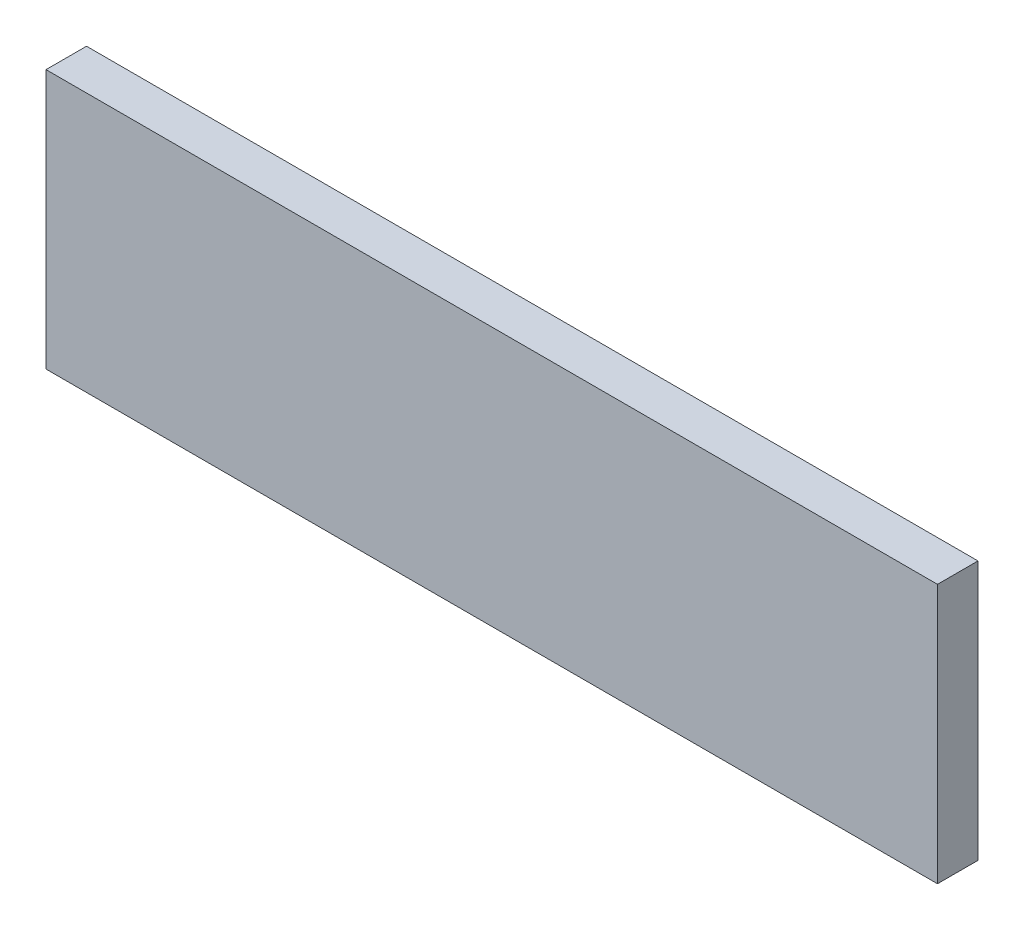
ISO-10303-21;
HEADER;
FILE_DESCRIPTION(('STEP AP214'),'2;1');
FILE_NAME('part.step','',(''),(''),'','','');
FILE_SCHEMA(('AUTOMOTIVE_DESIGN { 1 0 10303 214 1 1 1 1 }'));
ENDSEC;
DATA;
#1=APPLICATION_CONTEXT('core data for automotive mechanical design processes');
#2=APPLICATION_PROTOCOL_DEFINITION('international standard','automotive_design',2000,#1);
#3=PRODUCT_CONTEXT('',#1,'mechanical');
#4=PRODUCT('Part','Part','',(#3));
#5=PRODUCT_RELATED_PRODUCT_CATEGORY('part','',(#4));
#6=PRODUCT_DEFINITION_FORMATION('','',#4);
#7=PRODUCT_DEFINITION_CONTEXT('part definition',#1,'design');
#8=PRODUCT_DEFINITION('design','',#6,#7);
#9=PRODUCT_DEFINITION_SHAPE('','',#8);
#10=(LENGTH_UNIT() NAMED_UNIT(*) SI_UNIT(.MILLI.,.METRE.));
#11=(NAMED_UNIT(*) PLANE_ANGLE_UNIT() SI_UNIT($,.RADIAN.));
#12=(NAMED_UNIT(*) SI_UNIT($,.STERADIAN.) SOLID_ANGLE_UNIT());
#13=UNCERTAINTY_MEASURE_WITH_UNIT(LENGTH_MEASURE(1.E-05),#10,'distance_accuracy_value','');
#14=(GEOMETRIC_REPRESENTATION_CONTEXT(3) GLOBAL_UNCERTAINTY_ASSIGNED_CONTEXT((#13)) GLOBAL_UNIT_ASSIGNED_CONTEXT((#10,
#11,#12)) REPRESENTATION_CONTEXT('',''));
#15=CARTESIAN_POINT('',(0.,0.,0.));
#16=DIRECTION('',(0.,0.,1.));
#17=DIRECTION('',(1.,0.,0.));
#18=AXIS2_PLACEMENT_3D('',#15,#16,#17);
#19=CARTESIAN_POINT('',(27.5,-8.,2.5));
#20=DIRECTION('',(-1.,0.,0.));
#21=DIRECTION('',(0.,0.,1.));
#22=AXIS2_PLACEMENT_3D('',#19,#20,#21);
#23=PLANE('',#22);
#24=DIRECTION('',(0.,1.,0.));
#25=VECTOR('',#24,1.);
#26=CARTESIAN_POINT('',(27.5,-8.,0.));
#27=LINE('',#26,#25);
#28=CARTESIAN_POINT('',(27.5,-8.,0.));
#29=VERTEX_POINT('',#28);
#30=CARTESIAN_POINT('',(27.5,8.,0.));
#31=VERTEX_POINT('',#30);
#32=EDGE_CURVE('E96',#29,#31,#27,.T.);
#33=ORIENTED_EDGE('',*,*,#32,.T.);
#34=DIRECTION('',(0.,0.,-1.));
#35=VECTOR('',#34,1.);
#36=CARTESIAN_POINT('',(27.5,8.,2.5));
#37=LINE('',#36,#35);
#38=CARTESIAN_POINT('',(27.5,8.,2.5));
#39=VERTEX_POINT('',#38);
#40=EDGE_CURVE('E11',#39,#31,#37,.T.);
#41=ORIENTED_EDGE('',*,*,#40,.F.);
#42=DIRECTION('',(0.,1.,0.));
#43=VECTOR('',#42,1.);
#44=CARTESIAN_POINT('',(27.5,-8.,2.5));
#45=LINE('',#44,#43);
#46=CARTESIAN_POINT('',(27.5,-8.,2.5));
#47=VERTEX_POINT('',#46);
#48=EDGE_CURVE('E84',#47,#39,#45,.T.);
#49=ORIENTED_EDGE('',*,*,#48,.F.);
#50=DIRECTION('',(0.,0.,-1.));
#51=VECTOR('',#50,1.);
#52=CARTESIAN_POINT('',(27.5,-8.,2.5));
#53=LINE('',#52,#51);
#54=EDGE_CURVE('E92',#47,#29,#53,.T.);
#55=ORIENTED_EDGE('',*,*,#54,.T.);
#56=EDGE_LOOP('',(#33,#41,#49,#55));
#57=FACE_BOUND('',#56,.T.);
#58=ADVANCED_FACE('F33',(#57),#23,.F.);
#59=CARTESIAN_POINT('',(-27.5,8.,2.5));
#60=DIRECTION('',(0.,-1.,0.));
#61=DIRECTION('',(0.,0.,-1.));
#62=AXIS2_PLACEMENT_3D('',#59,#60,#61);
#63=PLANE('',#62);
#64=DIRECTION('',(-1.,0.,0.));
#65=VECTOR('',#64,1.);
#66=CARTESIAN_POINT('',(-27.5,8.,0.));
#67=LINE('',#66,#65);
#68=CARTESIAN_POINT('',(-27.5,8.,0.));
#69=VERTEX_POINT('',#68);
#70=EDGE_CURVE('E88',#31,#69,#67,.T.);
#71=ORIENTED_EDGE('',*,*,#70,.T.);
#72=DIRECTION('',(0.,0.,-1.));
#73=VECTOR('',#72,1.);
#74=CARTESIAN_POINT('',(-27.5,8.,2.5));
#75=LINE('',#74,#73);
#76=CARTESIAN_POINT('',(-27.5,8.,2.5));
#77=VERTEX_POINT('',#76);
#78=EDGE_CURVE('E41',#77,#69,#75,.T.);
#79=ORIENTED_EDGE('',*,*,#78,.F.);
#80=DIRECTION('',(-1.,0.,0.));
#81=VECTOR('',#80,1.);
#82=CARTESIAN_POINT('',(-27.5,8.,2.5));
#83=LINE('',#82,#81);
#84=EDGE_CURVE('E79',#39,#77,#83,.T.);
#85=ORIENTED_EDGE('',*,*,#84,.F.);
#86=ORIENTED_EDGE('',*,*,#40,.T.);
#87=EDGE_LOOP('',(#71,#79,#85,#86));
#88=FACE_BOUND('',#87,.T.);
#89=ADVANCED_FACE('F87',(#88),#63,.F.);
#90=CARTESIAN_POINT('',(-27.5,-8.,2.5));
#91=DIRECTION('',(1.,0.,0.));
#92=DIRECTION('',(0.,0.,-1.));
#93=AXIS2_PLACEMENT_3D('',#90,#91,#92);
#94=PLANE('',#93);
#95=DIRECTION('',(0.,-1.,0.));
#96=VECTOR('',#95,1.);
#97=CARTESIAN_POINT('',(-27.5,-8.,0.));
#98=LINE('',#97,#96);
#99=CARTESIAN_POINT('',(-27.5,-8.,0.));
#100=VERTEX_POINT('',#99);
#101=EDGE_CURVE('E66',#69,#100,#98,.T.);
#102=ORIENTED_EDGE('',*,*,#101,.T.);
#103=DIRECTION('',(0.,0.,-1.));
#104=VECTOR('',#103,1.);
#105=CARTESIAN_POINT('',(-27.5,-8.,2.5));
#106=LINE('',#105,#104);
#107=CARTESIAN_POINT('',(-27.5,-8.,2.5));
#108=VERTEX_POINT('',#107);
#109=EDGE_CURVE('E89',#108,#100,#106,.T.);
#110=ORIENTED_EDGE('',*,*,#109,.F.);
#111=DIRECTION('',(0.,-1.,0.));
#112=VECTOR('',#111,1.);
#113=CARTESIAN_POINT('',(-27.5,-8.,2.5));
#114=LINE('',#113,#112);
#115=EDGE_CURVE('E82',#77,#108,#114,.T.);
#116=ORIENTED_EDGE('',*,*,#115,.F.);
#117=ORIENTED_EDGE('',*,*,#78,.T.);
#118=EDGE_LOOP('',(#102,#110,#116,#117));
#119=FACE_BOUND('',#118,.T.);
#120=ADVANCED_FACE('F90',(#119),#94,.F.);
#121=CARTESIAN_POINT('',(-27.5,-8.,2.5));
#122=DIRECTION('',(0.,1.,0.));
#123=DIRECTION('',(0.,0.,1.));
#124=AXIS2_PLACEMENT_3D('',#121,#122,#123);
#125=PLANE('',#124);
#126=DIRECTION('',(1.,0.,0.));
#127=VECTOR('',#126,1.);
#128=CARTESIAN_POINT('',(-27.5,-8.,0.));
#129=LINE('',#128,#127);
#130=EDGE_CURVE('E72',#100,#29,#129,.T.);
#131=ORIENTED_EDGE('',*,*,#130,.T.);
#132=ORIENTED_EDGE('',*,*,#54,.F.);
#133=DIRECTION('',(1.,0.,0.));
#134=VECTOR('',#133,1.);
#135=CARTESIAN_POINT('',(-27.5,-8.,2.5));
#136=LINE('',#135,#134);
#137=EDGE_CURVE('E49',#108,#47,#136,.T.);
#138=ORIENTED_EDGE('',*,*,#137,.F.);
#139=ORIENTED_EDGE('',*,*,#109,.T.);
#140=EDGE_LOOP('',(#131,#132,#138,#139));
#141=FACE_BOUND('',#140,.T.);
#142=ADVANCED_FACE('F103',(#141),#125,.F.);
#143=CARTESIAN_POINT('',(0.,0.,2.5));
#144=DIRECTION('',(0.,0.,-1.));
#145=DIRECTION('',(-1.,0.,0.));
#146=AXIS2_PLACEMENT_3D('',#143,#144,#145);
#147=PLANE('',#146);
#148=ORIENTED_EDGE('',*,*,#48,.T.);
#149=ORIENTED_EDGE('',*,*,#84,.T.);
#150=ORIENTED_EDGE('',*,*,#115,.T.);
#151=ORIENTED_EDGE('',*,*,#137,.T.);
#152=EDGE_LOOP('',(#148,#149,#150,#151));
#153=FACE_BOUND('',#152,.T.);
#154=ADVANCED_FACE('F80',(#153),#147,.F.);
#155=CARTESIAN_POINT('',(0.,0.,0.));
#156=DIRECTION('',(0.,0.,-1.));
#157=DIRECTION('',(-1.,0.,0.));
#158=AXIS2_PLACEMENT_3D('',#155,#156,#157);
#159=PLANE('',#158);
#160=ORIENTED_EDGE('',*,*,#32,.F.);
#161=ORIENTED_EDGE('',*,*,#130,.F.);
#162=ORIENTED_EDGE('',*,*,#101,.F.);
#163=ORIENTED_EDGE('',*,*,#70,.F.);
#164=EDGE_LOOP('',(#160,#161,#162,#163));
#165=FACE_BOUND('',#164,.T.);
#166=ADVANCED_FACE('F106',(#165),#159,.T.);
#167=CLOSED_SHELL('',(#58,#89,#120,#142,#154,#166));
#168=MANIFOLD_SOLID_BREP('B2',#167);
#169=ADVANCED_BREP_SHAPE_REPRESENTATION('',(#18,#168),#14);
#170=SHAPE_DEFINITION_REPRESENTATION(#9,#169);
ENDSEC;
END-ISO-10303-21;
